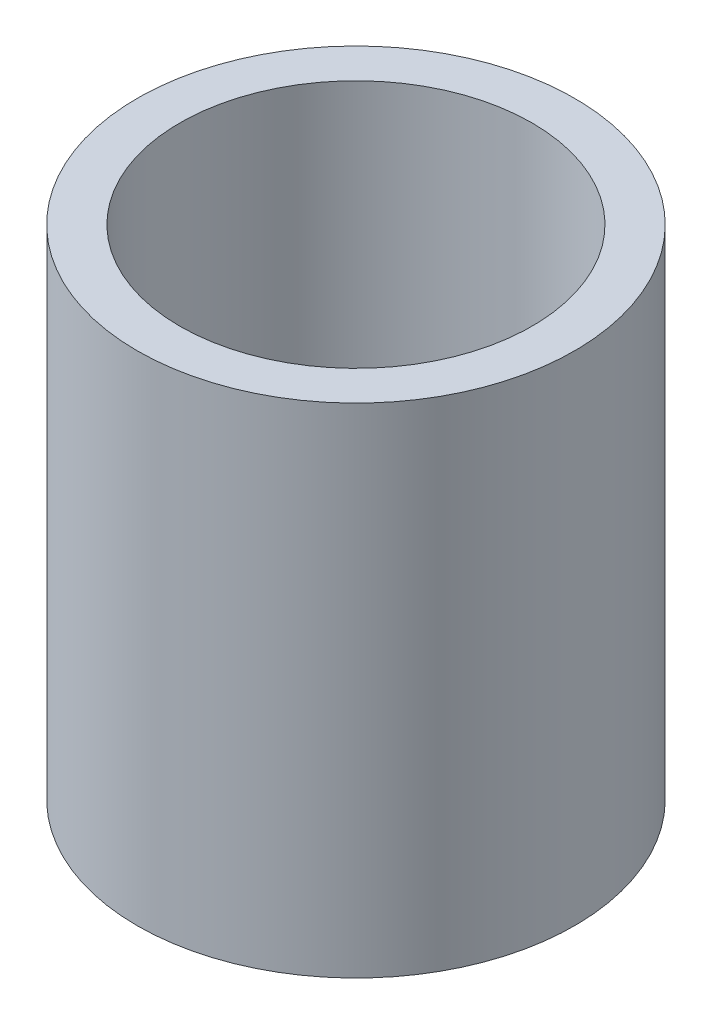
ISO-10303-21;
HEADER;
FILE_DESCRIPTION(('STEP AP214'),'2;1');
FILE_NAME('part.step','',(''),(''),'','','');
FILE_SCHEMA(('AUTOMOTIVE_DESIGN { 1 0 10303 214 1 1 1 1 }'));
ENDSEC;
DATA;
#1=APPLICATION_CONTEXT('core data for automotive mechanical design processes');
#2=APPLICATION_PROTOCOL_DEFINITION('international standard','automotive_design',2000,#1);
#3=PRODUCT_CONTEXT('',#1,'mechanical');
#4=PRODUCT('Part','Part','',(#3));
#5=PRODUCT_RELATED_PRODUCT_CATEGORY('part','',(#4));
#6=PRODUCT_DEFINITION_FORMATION('','',#4);
#7=PRODUCT_DEFINITION_CONTEXT('part definition',#1,'design');
#8=PRODUCT_DEFINITION('design','',#6,#7);
#9=PRODUCT_DEFINITION_SHAPE('','',#8);
#10=(LENGTH_UNIT() NAMED_UNIT(*) SI_UNIT(.MILLI.,.METRE.));
#11=(NAMED_UNIT(*) PLANE_ANGLE_UNIT() SI_UNIT($,.RADIAN.));
#12=(NAMED_UNIT(*) SI_UNIT($,.STERADIAN.) SOLID_ANGLE_UNIT());
#13=UNCERTAINTY_MEASURE_WITH_UNIT(LENGTH_MEASURE(1.E-05),#10,'distance_accuracy_value','');
#14=(GEOMETRIC_REPRESENTATION_CONTEXT(3) GLOBAL_UNCERTAINTY_ASSIGNED_CONTEXT((#13)) GLOBAL_UNIT_ASSIGNED_CONTEXT((#10,
#11,#12)) REPRESENTATION_CONTEXT('',''));
#15=CARTESIAN_POINT('',(0.,0.,0.));
#16=DIRECTION('',(0.,0.,1.));
#17=DIRECTION('',(1.,0.,0.));
#18=AXIS2_PLACEMENT_3D('',#15,#16,#17);
#19=CARTESIAN_POINT('',(0.,62.6105707574387,0.));
#20=DIRECTION('',(0.,-1.,0.));
#21=DIRECTION('',(0.,0.,-1.));
#22=AXIS2_PLACEMENT_3D('',#19,#20,#21);
#23=CYLINDRICAL_SURFACE('',#22,27.5);
#24=CARTESIAN_POINT('',(0.,62.6105707574387,0.));
#25=DIRECTION('',(0.,1.,0.));
#26=DIRECTION('',(0.,0.,1.));
#27=AXIS2_PLACEMENT_3D('',#24,#25,#26);
#28=CIRCLE('',#27,27.5);
#29=CARTESIAN_POINT('',(0.,62.6105707574387,27.5));
#30=VERTEX_POINT('',#29);
#31=EDGE_CURVE('E10',#30,#30,#28,.T.);
#32=ORIENTED_EDGE('',*,*,#31,.F.);
#33=EDGE_LOOP('',(#32));
#34=FACE_BOUND('',#33,.T.);
#35=CARTESIAN_POINT('',(0.,0.,0.));
#36=DIRECTION('',(0.,1.,0.));
#37=DIRECTION('',(0.,0.,1.));
#38=AXIS2_PLACEMENT_3D('',#35,#36,#37);
#39=CIRCLE('',#38,27.5);
#40=CARTESIAN_POINT('',(0.,0.,27.5));
#41=VERTEX_POINT('',#40);
#42=EDGE_CURVE('E37',#41,#41,#39,.T.);
#43=ORIENTED_EDGE('',*,*,#42,.T.);
#44=EDGE_LOOP('',(#43));
#45=FACE_BOUND('',#44,.T.);
#46=ADVANCED_FACE('F40',(#34,#45),#23,.T.);
#47=CARTESIAN_POINT('',(0.,62.6105707574387,0.));
#48=DIRECTION('',(0.,1.,0.));
#49=DIRECTION('',(0.,0.,1.));
#50=AXIS2_PLACEMENT_3D('',#47,#48,#49);
#51=PLANE('',#50);
#52=CARTESIAN_POINT('',(0.,62.6105707574387,0.));
#53=DIRECTION('',(0.,1.,0.));
#54=DIRECTION('',(0.,0.,1.));
#55=AXIS2_PLACEMENT_3D('',#52,#53,#54);
#56=CIRCLE('',#55,22.1462723523244);
#57=CARTESIAN_POINT('',(0.,62.6105707574387,22.1462723523244));
#58=VERTEX_POINT('',#57);
#59=EDGE_CURVE('E50',#58,#58,#56,.T.);
#60=ORIENTED_EDGE('',*,*,#59,.F.);
#61=EDGE_LOOP('',(#60));
#62=FACE_BOUND('',#61,.T.);
#63=ORIENTED_EDGE('',*,*,#31,.T.);
#64=EDGE_LOOP('',(#63));
#65=FACE_BOUND('',#64,.T.);
#66=ADVANCED_FACE('F59',(#62,#65),#51,.T.);
#67=CARTESIAN_POINT('',(0.,0.,0.));
#68=DIRECTION('',(0.,1.,0.));
#69=DIRECTION('',(0.,0.,1.));
#70=AXIS2_PLACEMENT_3D('',#67,#68,#69);
#71=PLANE('',#70);
#72=CARTESIAN_POINT('',(0.,0.,0.));
#73=DIRECTION('',(0.,1.,0.));
#74=DIRECTION('',(0.,0.,1.));
#75=AXIS2_PLACEMENT_3D('',#72,#73,#74);
#76=CIRCLE('',#75,22.1462723523244);
#77=CARTESIAN_POINT('',(0.,0.,22.1462723523244));
#78=VERTEX_POINT('',#77);
#79=EDGE_CURVE('E47',#78,#78,#76,.T.);
#80=ORIENTED_EDGE('',*,*,#79,.T.);
#81=EDGE_LOOP('',(#80));
#82=FACE_BOUND('',#81,.T.);
#83=ORIENTED_EDGE('',*,*,#42,.F.);
#84=EDGE_LOOP('',(#83));
#85=FACE_BOUND('',#84,.T.);
#86=ADVANCED_FACE('F58',(#82,#85),#71,.F.);
#87=CARTESIAN_POINT('',(0.,62.6105707574387,0.));
#88=DIRECTION('',(0.,-1.,0.));
#89=DIRECTION('',(0.,0.,-1.));
#90=AXIS2_PLACEMENT_3D('',#87,#88,#89);
#91=CYLINDRICAL_SURFACE('',#90,22.1462723523244);
#92=ORIENTED_EDGE('',*,*,#59,.T.);
#93=EDGE_LOOP('',(#92));
#94=FACE_BOUND('',#93,.T.);
#95=ORIENTED_EDGE('',*,*,#79,.F.);
#96=EDGE_LOOP('',(#95));
#97=FACE_BOUND('',#96,.T.);
#98=ADVANCED_FACE('F54',(#94,#97),#91,.F.);
#99=CLOSED_SHELL('',(#46,#66,#86,#98));
#100=MANIFOLD_SOLID_BREP('B2',#99);
#101=ADVANCED_BREP_SHAPE_REPRESENTATION('',(#18,#100),#14);
#102=SHAPE_DEFINITION_REPRESENTATION(#9,#101);
ENDSEC;
END-ISO-10303-21;
